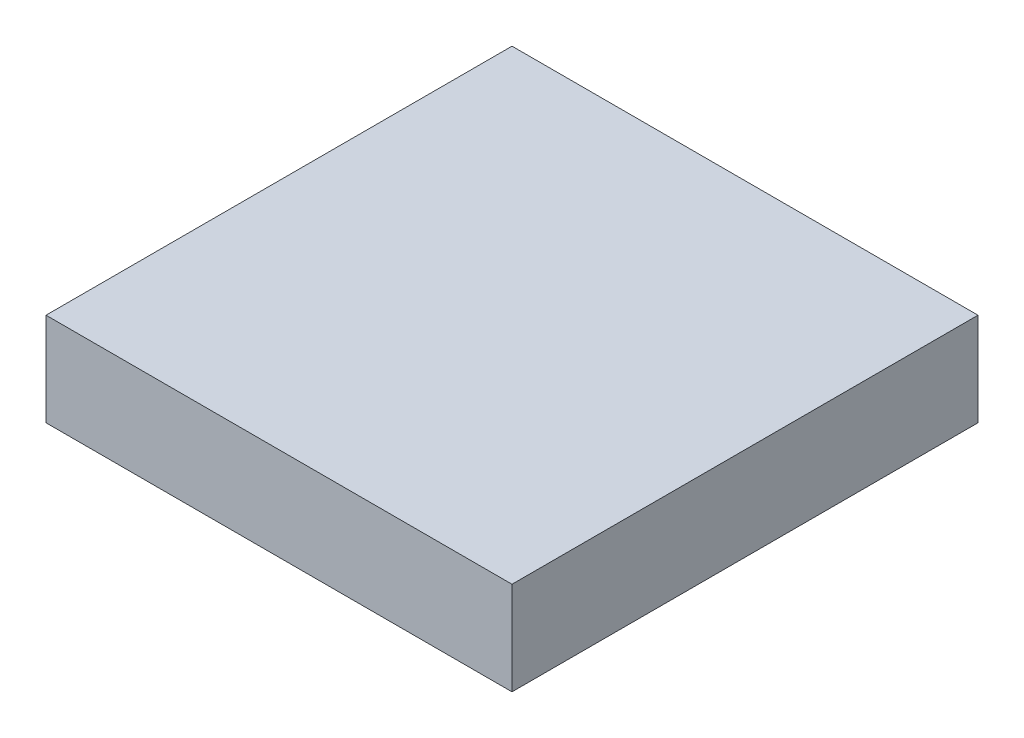
ISO-10303-21;
HEADER;
FILE_DESCRIPTION(('STEP AP214'),'2;1');
FILE_NAME('part.step','',(''),(''),'','','');
FILE_SCHEMA(('AUTOMOTIVE_DESIGN { 1 0 10303 214 1 1 1 1 }'));
ENDSEC;
DATA;
#1=APPLICATION_CONTEXT('core data for automotive mechanical design processes');
#2=APPLICATION_PROTOCOL_DEFINITION('international standard','automotive_design',2000,#1);
#3=PRODUCT_CONTEXT('',#1,'mechanical');
#4=PRODUCT('Part','Part','',(#3));
#5=PRODUCT_RELATED_PRODUCT_CATEGORY('part','',(#4));
#6=PRODUCT_DEFINITION_FORMATION('','',#4);
#7=PRODUCT_DEFINITION_CONTEXT('part definition',#1,'design');
#8=PRODUCT_DEFINITION('design','',#6,#7);
#9=PRODUCT_DEFINITION_SHAPE('','',#8);
#10=(LENGTH_UNIT() NAMED_UNIT(*) SI_UNIT(.MILLI.,.METRE.));
#11=(NAMED_UNIT(*) PLANE_ANGLE_UNIT() SI_UNIT($,.RADIAN.));
#12=(NAMED_UNIT(*) SI_UNIT($,.STERADIAN.) SOLID_ANGLE_UNIT());
#13=UNCERTAINTY_MEASURE_WITH_UNIT(LENGTH_MEASURE(1.E-05),#10,'distance_accuracy_value','');
#14=(GEOMETRIC_REPRESENTATION_CONTEXT(3) GLOBAL_UNCERTAINTY_ASSIGNED_CONTEXT((#13)) GLOBAL_UNIT_ASSIGNED_CONTEXT((#10,
#11,#12)) REPRESENTATION_CONTEXT('',''));
#15=CARTESIAN_POINT('',(0.,0.,0.));
#16=DIRECTION('',(0.,0.,1.));
#17=DIRECTION('',(1.,0.,0.));
#18=AXIS2_PLACEMENT_3D('',#15,#16,#17);
#19=CARTESIAN_POINT('',(7.5,3.,7.5));
#20=DIRECTION('',(-1.,0.,0.));
#21=DIRECTION('',(0.,0.,1.));
#22=AXIS2_PLACEMENT_3D('',#19,#20,#21);
#23=PLANE('',#22);
#24=DIRECTION('',(0.,0.,-1.));
#25=VECTOR('',#24,1.);
#26=CARTESIAN_POINT('',(7.5,0.,7.5));
#27=LINE('',#26,#25);
#28=CARTESIAN_POINT('',(7.5,0.,7.5));
#29=VERTEX_POINT('',#28);
#30=CARTESIAN_POINT('',(7.5,0.,-7.5));
#31=VERTEX_POINT('',#30);
#32=EDGE_CURVE('E96',#29,#31,#27,.T.);
#33=ORIENTED_EDGE('',*,*,#32,.T.);
#34=DIRECTION('',(0.,-1.,0.));
#35=VECTOR('',#34,1.);
#36=CARTESIAN_POINT('',(7.5,3.,-7.5));
#37=LINE('',#36,#35);
#38=CARTESIAN_POINT('',(7.5,3.,-7.5));
#39=VERTEX_POINT('',#38);
#40=EDGE_CURVE('E11',#39,#31,#37,.T.);
#41=ORIENTED_EDGE('',*,*,#40,.F.);
#42=DIRECTION('',(0.,0.,-1.));
#43=VECTOR('',#42,1.);
#44=CARTESIAN_POINT('',(7.5,3.,7.5));
#45=LINE('',#44,#43);
#46=CARTESIAN_POINT('',(7.5,3.,7.5));
#47=VERTEX_POINT('',#46);
#48=EDGE_CURVE('E84',#47,#39,#45,.T.);
#49=ORIENTED_EDGE('',*,*,#48,.F.);
#50=DIRECTION('',(0.,-1.,0.));
#51=VECTOR('',#50,1.);
#52=CARTESIAN_POINT('',(7.5,3.,7.5));
#53=LINE('',#52,#51);
#54=EDGE_CURVE('E92',#47,#29,#53,.T.);
#55=ORIENTED_EDGE('',*,*,#54,.T.);
#56=EDGE_LOOP('',(#33,#41,#49,#55));
#57=FACE_BOUND('',#56,.T.);
#58=ADVANCED_FACE('F33',(#57),#23,.F.);
#59=CARTESIAN_POINT('',(-7.5,3.,-7.5));
#60=DIRECTION('',(0.,0.,1.));
#61=DIRECTION('',(1.,0.,0.));
#62=AXIS2_PLACEMENT_3D('',#59,#60,#61);
#63=PLANE('',#62);
#64=DIRECTION('',(-1.,0.,0.));
#65=VECTOR('',#64,1.);
#66=CARTESIAN_POINT('',(-7.5,0.,-7.5));
#67=LINE('',#66,#65);
#68=CARTESIAN_POINT('',(-7.5,0.,-7.5));
#69=VERTEX_POINT('',#68);
#70=EDGE_CURVE('E88',#31,#69,#67,.T.);
#71=ORIENTED_EDGE('',*,*,#70,.T.);
#72=DIRECTION('',(0.,-1.,0.));
#73=VECTOR('',#72,1.);
#74=CARTESIAN_POINT('',(-7.5,3.,-7.5));
#75=LINE('',#74,#73);
#76=CARTESIAN_POINT('',(-7.5,3.,-7.5));
#77=VERTEX_POINT('',#76);
#78=EDGE_CURVE('E41',#77,#69,#75,.T.);
#79=ORIENTED_EDGE('',*,*,#78,.F.);
#80=DIRECTION('',(-1.,0.,0.));
#81=VECTOR('',#80,1.);
#82=CARTESIAN_POINT('',(-7.5,3.,-7.5));
#83=LINE('',#82,#81);
#84=EDGE_CURVE('E79',#39,#77,#83,.T.);
#85=ORIENTED_EDGE('',*,*,#84,.F.);
#86=ORIENTED_EDGE('',*,*,#40,.T.);
#87=EDGE_LOOP('',(#71,#79,#85,#86));
#88=FACE_BOUND('',#87,.T.);
#89=ADVANCED_FACE('F87',(#88),#63,.F.);
#90=CARTESIAN_POINT('',(-7.5,3.,7.5));
#91=DIRECTION('',(1.,0.,0.));
#92=DIRECTION('',(0.,0.,-1.));
#93=AXIS2_PLACEMENT_3D('',#90,#91,#92);
#94=PLANE('',#93);
#95=DIRECTION('',(0.,0.,1.));
#96=VECTOR('',#95,1.);
#97=CARTESIAN_POINT('',(-7.5,0.,7.5));
#98=LINE('',#97,#96);
#99=CARTESIAN_POINT('',(-7.5,0.,7.5));
#100=VERTEX_POINT('',#99);
#101=EDGE_CURVE('E66',#69,#100,#98,.T.);
#102=ORIENTED_EDGE('',*,*,#101,.T.);
#103=DIRECTION('',(0.,-1.,0.));
#104=VECTOR('',#103,1.);
#105=CARTESIAN_POINT('',(-7.5,3.,7.5));
#106=LINE('',#105,#104);
#107=CARTESIAN_POINT('',(-7.5,3.,7.5));
#108=VERTEX_POINT('',#107);
#109=EDGE_CURVE('E89',#108,#100,#106,.T.);
#110=ORIENTED_EDGE('',*,*,#109,.F.);
#111=DIRECTION('',(0.,0.,1.));
#112=VECTOR('',#111,1.);
#113=CARTESIAN_POINT('',(-7.5,3.,7.5));
#114=LINE('',#113,#112);
#115=EDGE_CURVE('E82',#77,#108,#114,.T.);
#116=ORIENTED_EDGE('',*,*,#115,.F.);
#117=ORIENTED_EDGE('',*,*,#78,.T.);
#118=EDGE_LOOP('',(#102,#110,#116,#117));
#119=FACE_BOUND('',#118,.T.);
#120=ADVANCED_FACE('F90',(#119),#94,.F.);
#121=CARTESIAN_POINT('',(-7.5,3.,7.5));
#122=DIRECTION('',(0.,0.,-1.));
#123=DIRECTION('',(-1.,0.,0.));
#124=AXIS2_PLACEMENT_3D('',#121,#122,#123);
#125=PLANE('',#124);
#126=DIRECTION('',(1.,0.,0.));
#127=VECTOR('',#126,1.);
#128=CARTESIAN_POINT('',(-7.5,0.,7.5));
#129=LINE('',#128,#127);
#130=EDGE_CURVE('E72',#100,#29,#129,.T.);
#131=ORIENTED_EDGE('',*,*,#130,.T.);
#132=ORIENTED_EDGE('',*,*,#54,.F.);
#133=DIRECTION('',(1.,0.,0.));
#134=VECTOR('',#133,1.);
#135=CARTESIAN_POINT('',(-7.5,3.,7.5));
#136=LINE('',#135,#134);
#137=EDGE_CURVE('E49',#108,#47,#136,.T.);
#138=ORIENTED_EDGE('',*,*,#137,.F.);
#139=ORIENTED_EDGE('',*,*,#109,.T.);
#140=EDGE_LOOP('',(#131,#132,#138,#139));
#141=FACE_BOUND('',#140,.T.);
#142=ADVANCED_FACE('F104',(#141),#125,.F.);
#143=CARTESIAN_POINT('',(0.,3.,0.));
#144=DIRECTION('',(0.,-1.,0.));
#145=DIRECTION('',(0.,0.,-1.));
#146=AXIS2_PLACEMENT_3D('',#143,#144,#145);
#147=PLANE('',#146);
#148=ORIENTED_EDGE('',*,*,#48,.T.);
#149=ORIENTED_EDGE('',*,*,#84,.T.);
#150=ORIENTED_EDGE('',*,*,#115,.T.);
#151=ORIENTED_EDGE('',*,*,#137,.T.);
#152=EDGE_LOOP('',(#148,#149,#150,#151));
#153=FACE_BOUND('',#152,.T.);
#154=ADVANCED_FACE('F80',(#153),#147,.F.);
#155=CARTESIAN_POINT('',(0.,0.,0.));
#156=DIRECTION('',(0.,-1.,0.));
#157=DIRECTION('',(0.,0.,-1.));
#158=AXIS2_PLACEMENT_3D('',#155,#156,#157);
#159=PLANE('',#158);
#160=CARTESIAN_POINT('',(-5.5,0.,-5.5));
#161=DIRECTION('',(0.,-1.,0.));
#162=DIRECTION('',(0.,0.,-1.));
#163=AXIS2_PLACEMENT_3D('',#160,#161,#162);
#164=CIRCLE('',#163,1.25);
#165=CARTESIAN_POINT('',(-5.5,0.,-6.75));
#166=VERTEX_POINT('',#165);
#167=EDGE_CURVE('E128',#166,#166,#164,.T.);
#168=ORIENTED_EDGE('',*,*,#167,.F.);
#169=EDGE_LOOP('',(#168));
#170=FACE_BOUND('',#169,.T.);
#171=CARTESIAN_POINT('',(5.5,0.,-5.5));
#172=DIRECTION('',(0.,-1.,0.));
#173=DIRECTION('',(0.,0.,-1.));
#174=AXIS2_PLACEMENT_3D('',#171,#172,#173);
#175=CIRCLE('',#174,1.25);
#176=CARTESIAN_POINT('',(5.5,0.,-6.75));
#177=VERTEX_POINT('',#176);
#178=EDGE_CURVE('E134',#177,#177,#175,.T.);
#179=ORIENTED_EDGE('',*,*,#178,.F.);
#180=EDGE_LOOP('',(#179));
#181=FACE_BOUND('',#180,.T.);
#182=CARTESIAN_POINT('',(5.5,0.,5.5));
#183=DIRECTION('',(0.,-1.,0.));
#184=DIRECTION('',(0.,0.,-1.));
#185=AXIS2_PLACEMENT_3D('',#182,#183,#184);
#186=CIRCLE('',#185,1.25);
#187=CARTESIAN_POINT('',(5.5,0.,4.25));
#188=VERTEX_POINT('',#187);
#189=EDGE_CURVE('E140',#188,#188,#186,.T.);
#190=ORIENTED_EDGE('',*,*,#189,.F.);
#191=EDGE_LOOP('',(#190));
#192=FACE_BOUND('',#191,.T.);
#193=CARTESIAN_POINT('',(-5.5,0.,5.5));
#194=DIRECTION('',(0.,-1.,0.));
#195=DIRECTION('',(0.,0.,-1.));
#196=AXIS2_PLACEMENT_3D('',#193,#194,#195);
#197=CIRCLE('',#196,1.25);
#198=CARTESIAN_POINT('',(-5.5,0.,4.25));
#199=VERTEX_POINT('',#198);
#200=EDGE_CURVE('E122',#199,#199,#197,.T.);
#201=ORIENTED_EDGE('',*,*,#200,.F.);
#202=EDGE_LOOP('',(#201));
#203=FACE_BOUND('',#202,.T.);
#204=CARTESIAN_POINT('',(0.,0.,0.));
#205=DIRECTION('',(0.,-1.,0.));
#206=DIRECTION('',(0.,0.,-1.));
#207=AXIS2_PLACEMENT_3D('',#204,#205,#206);
#208=CIRCLE('',#207,6.);
#209=CARTESIAN_POINT('',(0.,0.,-6.));
#210=VERTEX_POINT('',#209);
#211=EDGE_CURVE('E110',#210,#210,#208,.T.);
#212=ORIENTED_EDGE('',*,*,#211,.F.);
#213=EDGE_LOOP('',(#212));
#214=FACE_BOUND('',#213,.T.);
#215=ORIENTED_EDGE('',*,*,#32,.F.);
#216=ORIENTED_EDGE('',*,*,#130,.F.);
#217=ORIENTED_EDGE('',*,*,#101,.F.);
#218=ORIENTED_EDGE('',*,*,#70,.F.);
#219=EDGE_LOOP('',(#215,#216,#217,#218));
#220=FACE_BOUND('',#219,.T.);
#221=ADVANCED_FACE('F107',(#170,#181,#192,#203,#214,#220),#159,.T.);
#222=CARTESIAN_POINT('',(0.,2.,0.));
#223=DIRECTION('',(0.,-1.,0.));
#224=DIRECTION('',(0.,0.,-1.));
#225=AXIS2_PLACEMENT_3D('',#222,#223,#224);
#226=CYLINDRICAL_SURFACE('',#225,6.);
#227=CARTESIAN_POINT('',(0.,2.,0.));
#228=DIRECTION('',(0.,-1.,0.));
#229=DIRECTION('',(0.,0.,-1.));
#230=AXIS2_PLACEMENT_3D('',#227,#228,#229);
#231=CIRCLE('',#230,6.);
#232=CARTESIAN_POINT('',(0.,2.,-6.));
#233=VERTEX_POINT('',#232);
#234=EDGE_CURVE('E99',#233,#233,#231,.T.);
#235=ORIENTED_EDGE('',*,*,#234,.F.);
#236=EDGE_LOOP('',(#235));
#237=FACE_BOUND('',#236,.T.);
#238=ORIENTED_EDGE('',*,*,#211,.T.);
#239=EDGE_LOOP('',(#238));
#240=FACE_BOUND('',#239,.T.);
#241=ADVANCED_FACE('F157',(#237,#240),#226,.F.);
#242=CARTESIAN_POINT('',(0.,2.,0.));
#243=DIRECTION('',(0.,-1.,0.));
#244=DIRECTION('',(0.,0.,-1.));
#245=AXIS2_PLACEMENT_3D('',#242,#243,#244);
#246=PLANE('',#245);
#247=CARTESIAN_POINT('',(0.,2.,0.));
#248=DIRECTION('',(0.,-1.,0.));
#249=DIRECTION('',(0.,0.,-1.));
#250=AXIS2_PLACEMENT_3D('',#247,#248,#249);
#251=CIRCLE('',#250,2.5);
#252=CARTESIAN_POINT('',(0.,2.,-2.5));
#253=VERTEX_POINT('',#252);
#254=EDGE_CURVE('E113',#253,#253,#251,.T.);
#255=ORIENTED_EDGE('',*,*,#254,.F.);
#256=EDGE_LOOP('',(#255));
#257=FACE_BOUND('',#256,.T.);
#258=ORIENTED_EDGE('',*,*,#234,.T.);
#259=EDGE_LOOP('',(#258));
#260=FACE_BOUND('',#259,.T.);
#261=ADVANCED_FACE('F166',(#257,#260),#246,.T.);
#262=CARTESIAN_POINT('',(0.,2.,0.));
#263=DIRECTION('',(0.,-1.,0.));
#264=DIRECTION('',(0.,0.,-1.));
#265=AXIS2_PLACEMENT_3D('',#262,#263,#264);
#266=CYLINDRICAL_SURFACE('',#265,2.5);
#267=ORIENTED_EDGE('',*,*,#254,.T.);
#268=EDGE_LOOP('',(#267));
#269=FACE_BOUND('',#268,.T.);
#270=CARTESIAN_POINT('',(0.,0.,0.));
#271=DIRECTION('',(0.,-1.,0.));
#272=DIRECTION('',(0.,0.,-1.));
#273=AXIS2_PLACEMENT_3D('',#270,#271,#272);
#274=CIRCLE('',#273,2.5);
#275=CARTESIAN_POINT('',(0.,0.,-2.5));
#276=VERTEX_POINT('',#275);
#277=EDGE_CURVE('E116',#276,#276,#274,.T.);
#278=ORIENTED_EDGE('',*,*,#277,.F.);
#279=EDGE_LOOP('',(#278));
#280=FACE_BOUND('',#279,.T.);
#281=ADVANCED_FACE('F172',(#269,#280),#266,.T.);
#282=ORIENTED_EDGE('',*,*,#277,.T.);
#283=EDGE_LOOP('',(#282));
#284=FACE_BOUND('',#283,.T.);
#285=ADVANCED_FACE('F160',(#284),#159,.T.);
#286=CARTESIAN_POINT('',(-5.5,2.,5.5));
#287=DIRECTION('',(0.,-1.,0.));
#288=DIRECTION('',(0.,0.,-1.));
#289=AXIS2_PLACEMENT_3D('',#286,#287,#288);
#290=CYLINDRICAL_SURFACE('',#289,1.25);
#291=CARTESIAN_POINT('',(-5.5,2.,5.5));
#292=DIRECTION('',(0.,-1.,0.));
#293=DIRECTION('',(0.,0.,-1.));
#294=AXIS2_PLACEMENT_3D('',#291,#292,#293);
#295=CIRCLE('',#294,1.25);
#296=CARTESIAN_POINT('',(-5.5,2.,4.25));
#297=VERTEX_POINT('',#296);
#298=EDGE_CURVE('E119',#297,#297,#295,.T.);
#299=ORIENTED_EDGE('',*,*,#298,.F.);
#300=EDGE_LOOP('',(#299));
#301=FACE_BOUND('',#300,.T.);
#302=ORIENTED_EDGE('',*,*,#200,.T.);
#303=EDGE_LOOP('',(#302));
#304=FACE_BOUND('',#303,.T.);
#305=ADVANCED_FACE('F206',(#301,#304),#290,.F.);
#306=CARTESIAN_POINT('',(-5.5,2.,5.5));
#307=DIRECTION('',(0.,-1.,0.));
#308=DIRECTION('',(0.,0.,-1.));
#309=AXIS2_PLACEMENT_3D('',#306,#307,#308);
#310=PLANE('',#309);
#311=ORIENTED_EDGE('',*,*,#298,.T.);
#312=EDGE_LOOP('',(#311));
#313=FACE_BOUND('',#312,.T.);
#314=ADVANCED_FACE('F151',(#313),#310,.T.);
#315=CARTESIAN_POINT('',(5.5,2.,5.5));
#316=DIRECTION('',(0.,-1.,0.));
#317=DIRECTION('',(0.,0.,-1.));
#318=AXIS2_PLACEMENT_3D('',#315,#316,#317);
#319=CYLINDRICAL_SURFACE('',#318,1.25);
#320=CARTESIAN_POINT('',(5.5,2.,5.5));
#321=DIRECTION('',(0.,-1.,0.));
#322=DIRECTION('',(0.,0.,-1.));
#323=AXIS2_PLACEMENT_3D('',#320,#321,#322);
#324=CIRCLE('',#323,1.25);
#325=CARTESIAN_POINT('',(5.5,2.,4.25));
#326=VERTEX_POINT('',#325);
#327=EDGE_CURVE('E125',#326,#326,#324,.T.);
#328=ORIENTED_EDGE('',*,*,#327,.F.);
#329=EDGE_LOOP('',(#328));
#330=FACE_BOUND('',#329,.T.);
#331=ORIENTED_EDGE('',*,*,#189,.T.);
#332=EDGE_LOOP('',(#331));
#333=FACE_BOUND('',#332,.T.);
#334=ADVANCED_FACE('F148',(#330,#333),#319,.F.);
#335=CARTESIAN_POINT('',(5.5,2.,5.5));
#336=DIRECTION('',(0.,-1.,0.));
#337=DIRECTION('',(0.,0.,-1.));
#338=AXIS2_PLACEMENT_3D('',#335,#336,#337);
#339=PLANE('',#338);
#340=ORIENTED_EDGE('',*,*,#327,.T.);
#341=EDGE_LOOP('',(#340));
#342=FACE_BOUND('',#341,.T.);
#343=ADVANCED_FACE('F146',(#342),#339,.T.);
#344=CARTESIAN_POINT('',(5.5,2.,-5.5));
#345=DIRECTION('',(0.,-1.,0.));
#346=DIRECTION('',(0.,0.,-1.));
#347=AXIS2_PLACEMENT_3D('',#344,#345,#346);
#348=CYLINDRICAL_SURFACE('',#347,1.25);
#349=CARTESIAN_POINT('',(5.5,2.,-5.5));
#350=DIRECTION('',(0.,-1.,0.));
#351=DIRECTION('',(0.,0.,-1.));
#352=AXIS2_PLACEMENT_3D('',#349,#350,#351);
#353=CIRCLE('',#352,1.25);
#354=CARTESIAN_POINT('',(5.5,2.,-6.75));
#355=VERTEX_POINT('',#354);
#356=EDGE_CURVE('E137',#355,#355,#353,.T.);
#357=ORIENTED_EDGE('',*,*,#356,.F.);
#358=EDGE_LOOP('',(#357));
#359=FACE_BOUND('',#358,.T.);
#360=ORIENTED_EDGE('',*,*,#178,.T.);
#361=EDGE_LOOP('',(#360));
#362=FACE_BOUND('',#361,.T.);
#363=ADVANCED_FACE('F236',(#359,#362),#348,.F.);
#364=CARTESIAN_POINT('',(5.5,2.,-5.5));
#365=DIRECTION('',(0.,-1.,0.));
#366=DIRECTION('',(0.,0.,-1.));
#367=AXIS2_PLACEMENT_3D('',#364,#365,#366);
#368=PLANE('',#367);
#369=ORIENTED_EDGE('',*,*,#356,.T.);
#370=EDGE_LOOP('',(#369));
#371=FACE_BOUND('',#370,.T.);
#372=ADVANCED_FACE('F245',(#371),#368,.T.);
#373=CARTESIAN_POINT('',(-5.5,2.,-5.5));
#374=DIRECTION('',(0.,-1.,0.));
#375=DIRECTION('',(0.,0.,-1.));
#376=AXIS2_PLACEMENT_3D('',#373,#374,#375);
#377=CYLINDRICAL_SURFACE('',#376,1.25);
#378=CARTESIAN_POINT('',(-5.5,2.,-5.5));
#379=DIRECTION('',(0.,-1.,0.));
#380=DIRECTION('',(0.,0.,-1.));
#381=AXIS2_PLACEMENT_3D('',#378,#379,#380);
#382=CIRCLE('',#381,1.25);
#383=CARTESIAN_POINT('',(-5.5,2.,-6.75));
#384=VERTEX_POINT('',#383);
#385=EDGE_CURVE('E131',#384,#384,#382,.T.);
#386=ORIENTED_EDGE('',*,*,#385,.F.);
#387=EDGE_LOOP('',(#386));
#388=FACE_BOUND('',#387,.T.);
#389=ORIENTED_EDGE('',*,*,#167,.T.);
#390=EDGE_LOOP('',(#389));
#391=FACE_BOUND('',#390,.T.);
#392=ADVANCED_FACE('F255',(#388,#391),#377,.F.);
#393=CARTESIAN_POINT('',(-5.5,2.,-5.5));
#394=DIRECTION('',(0.,-1.,0.));
#395=DIRECTION('',(0.,0.,-1.));
#396=AXIS2_PLACEMENT_3D('',#393,#394,#395);
#397=PLANE('',#396);
#398=ORIENTED_EDGE('',*,*,#385,.T.);
#399=EDGE_LOOP('',(#398));
#400=FACE_BOUND('',#399,.T.);
#401=ADVANCED_FACE('F265',(#400),#397,.T.);
#402=CLOSED_SHELL('',(#58,#89,#120,#142,#154,#221,#241,#261,#281,#285,#305,#314,#334,#343,#363,
#372,#392,#401));
#403=MANIFOLD_SOLID_BREP('B2',#402);
#404=ADVANCED_BREP_SHAPE_REPRESENTATION('',(#18,#403),#14);
#405=SHAPE_DEFINITION_REPRESENTATION(#9,#404);
ENDSEC;
END-ISO-10303-21;
